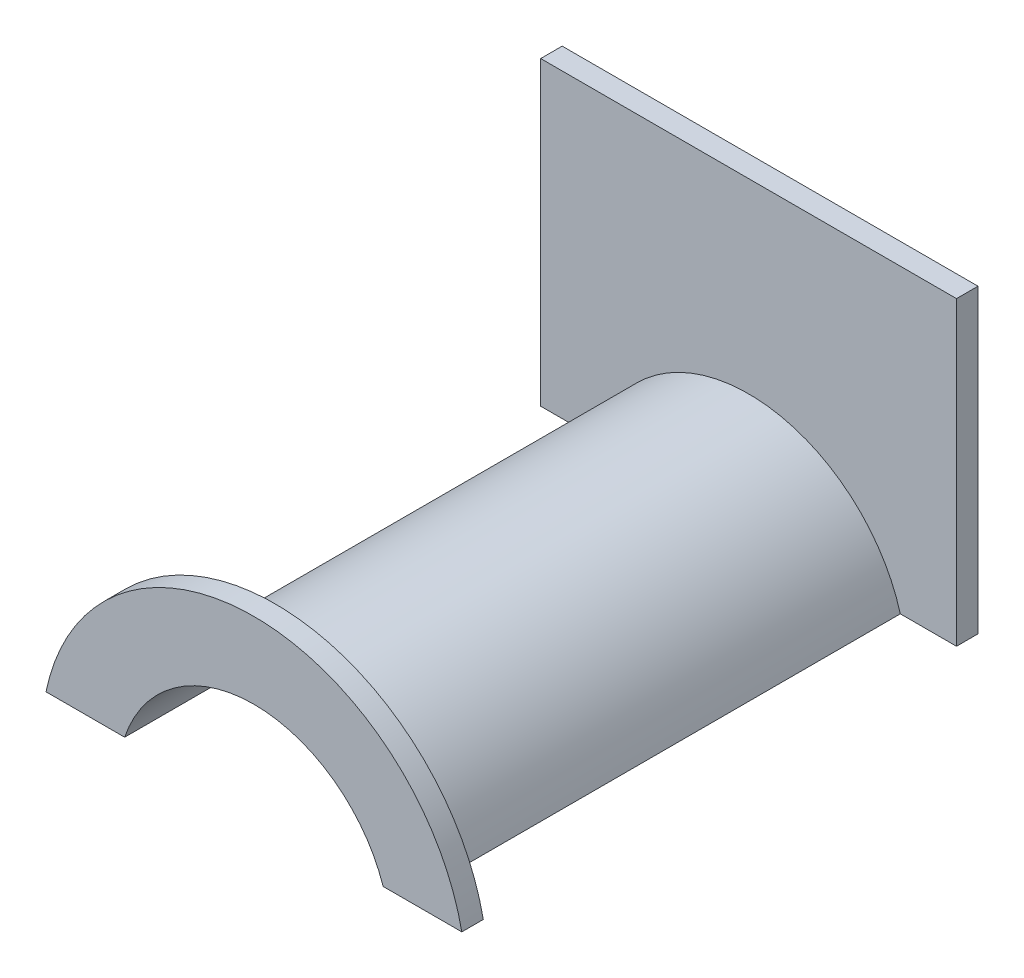
ISO-10303-21;
HEADER;
FILE_DESCRIPTION(('STEP AP214'),'2;1');
FILE_NAME('part.step','',(''),(''),'','','');
FILE_SCHEMA(('AUTOMOTIVE_DESIGN { 1 0 10303 214 1 1 1 1 }'));
ENDSEC;
DATA;
#1=APPLICATION_CONTEXT('core data for automotive mechanical design processes');
#2=APPLICATION_PROTOCOL_DEFINITION('international standard','automotive_design',2000,#1);
#3=PRODUCT_CONTEXT('',#1,'mechanical');
#4=PRODUCT('Part','Part','',(#3));
#5=PRODUCT_RELATED_PRODUCT_CATEGORY('part','',(#4));
#6=PRODUCT_DEFINITION_FORMATION('','',#4);
#7=PRODUCT_DEFINITION_CONTEXT('part definition',#1,'design');
#8=PRODUCT_DEFINITION('design','',#6,#7);
#9=PRODUCT_DEFINITION_SHAPE('','',#8);
#10=(LENGTH_UNIT() NAMED_UNIT(*) SI_UNIT(.MILLI.,.METRE.));
#11=(NAMED_UNIT(*) PLANE_ANGLE_UNIT() SI_UNIT($,.RADIAN.));
#12=(NAMED_UNIT(*) SI_UNIT($,.STERADIAN.) SOLID_ANGLE_UNIT());
#13=UNCERTAINTY_MEASURE_WITH_UNIT(LENGTH_MEASURE(1.E-05),#10,'distance_accuracy_value','');
#14=(GEOMETRIC_REPRESENTATION_CONTEXT(3) GLOBAL_UNCERTAINTY_ASSIGNED_CONTEXT((#13)) GLOBAL_UNIT_ASSIGNED_CONTEXT((#10,
#11,#12)) REPRESENTATION_CONTEXT('',''));
#15=CARTESIAN_POINT('',(0.,0.,0.));
#16=DIRECTION('',(0.,0.,1.));
#17=DIRECTION('',(1.,0.,0.));
#18=AXIS2_PLACEMENT_3D('',#15,#16,#17);
#19=CARTESIAN_POINT('',(0.29000000000002,0.20999999999998,-0.015));
#20=DIRECTION('',(1.,0.,0.));
#21=DIRECTION('',(0.,0.,-1.));
#22=AXIS2_PLACEMENT_3D('',#19,#20,#21);
#23=PLANE('',#22);
#24=DIRECTION('',(0.,1.,0.));
#25=VECTOR('',#24,1.);
#26=CARTESIAN_POINT('',(0.29000000000002,0.005704238144726,-0.015));
#27=LINE('',#26,#25);
#28=CARTESIAN_POINT('',(0.29000000000002,-0.210000000000017,-0.015));
#29=VERTEX_POINT('',#28);
#30=CARTESIAN_POINT('',(0.29000000000002,0.20999999999998,-0.015));
#31=VERTEX_POINT('',#30);
#32=EDGE_CURVE('E78',#29,#31,#27,.T.);
#33=ORIENTED_EDGE('',*,*,#32,.T.);
#34=DIRECTION('',(0.,0.,1.));
#35=VECTOR('',#34,1.);
#36=CARTESIAN_POINT('',(0.29000000000002,0.20999999999998,-0.015));
#37=LINE('',#36,#35);
#38=CARTESIAN_POINT('',(0.29000000000002,0.20999999999998,0.015));
#39=VERTEX_POINT('',#38);
#40=EDGE_CURVE('E97',#39,#31,#37,.F.);
#41=ORIENTED_EDGE('',*,*,#40,.F.);
#42=DIRECTION('',(0.,1.,0.));
#43=VECTOR('',#42,1.);
#44=CARTESIAN_POINT('',(0.29000000000002,0.005704238144726,0.015));
#45=LINE('',#44,#43);
#46=CARTESIAN_POINT('',(0.29000000000002,-0.210000000000012,0.015));
#47=VERTEX_POINT('',#46);
#48=EDGE_CURVE('E100',#47,#39,#45,.T.);
#49=ORIENTED_EDGE('',*,*,#48,.F.);
#50=DIRECTION('',(0.,0.,-1.));
#51=VECTOR('',#50,1.);
#52=CARTESIAN_POINT('',(0.29000000000002,-0.210000000000036,-0.015));
#53=LINE('',#52,#51);
#54=EDGE_CURVE('E115',#29,#47,#53,.F.);
#55=ORIENTED_EDGE('',*,*,#54,.F.);
#56=EDGE_LOOP('',(#33,#41,#49,#55));
#57=FACE_BOUND('',#56,.T.);
#58=ADVANCED_FACE('F16',(#57),#23,.T.);
#59=CARTESIAN_POINT('',(-0.289999999999964,0.20999999999998,-0.015));
#60=DIRECTION('',(0.,1.,0.));
#61=DIRECTION('',(0.,0.,1.));
#62=AXIS2_PLACEMENT_3D('',#59,#60,#61);
#63=PLANE('',#62);
#64=DIRECTION('',(1.,0.,0.));
#65=VECTOR('',#64,1.);
#66=CARTESIAN_POINT('',(0.,0.20999999999998,-0.015));
#67=LINE('',#66,#65);
#68=CARTESIAN_POINT('',(-0.289999999999964,0.20999999999998,-0.015));
#69=VERTEX_POINT('',#68);
#70=EDGE_CURVE('E135',#31,#69,#67,.F.);
#71=ORIENTED_EDGE('',*,*,#70,.T.);
#72=DIRECTION('',(0.,0.,1.));
#73=VECTOR('',#72,1.);
#74=CARTESIAN_POINT('',(-0.289999999999964,0.20999999999998,-0.015));
#75=LINE('',#74,#73);
#76=CARTESIAN_POINT('',(-0.289999999999964,0.20999999999998,0.015));
#77=VERTEX_POINT('',#76);
#78=EDGE_CURVE('E103',#77,#69,#75,.F.);
#79=ORIENTED_EDGE('',*,*,#78,.F.);
#80=DIRECTION('',(1.,0.,0.));
#81=VECTOR('',#80,1.);
#82=CARTESIAN_POINT('',(0.,0.20999999999998,0.015));
#83=LINE('',#82,#81);
#84=EDGE_CURVE('E106',#39,#77,#83,.F.);
#85=ORIENTED_EDGE('',*,*,#84,.F.);
#86=ORIENTED_EDGE('',*,*,#40,.T.);
#87=EDGE_LOOP('',(#71,#79,#85,#86));
#88=FACE_BOUND('',#87,.T.);
#89=ADVANCED_FACE('F107',(#88),#63,.T.);
#90=CARTESIAN_POINT('',(-0.289999999999964,-0.210000000000036,-0.015));
#91=DIRECTION('',(-1.,0.,0.));
#92=DIRECTION('',(0.,0.,1.));
#93=AXIS2_PLACEMENT_3D('',#90,#91,#92);
#94=PLANE('',#93);
#95=DIRECTION('',(0.,1.,0.));
#96=VECTOR('',#95,1.);
#97=CARTESIAN_POINT('',(-0.289999999999964,0.005704238144726,-0.015));
#98=LINE('',#97,#96);
#99=CARTESIAN_POINT('',(-0.289999999999964,-0.210000000000036,-0.015));
#100=VERTEX_POINT('',#99);
#101=EDGE_CURVE('E145',#69,#100,#98,.F.);
#102=ORIENTED_EDGE('',*,*,#101,.T.);
#103=DIRECTION('',(0.,0.,-1.));
#104=VECTOR('',#103,1.);
#105=CARTESIAN_POINT('',(-0.289999999999964,-0.210000000000036,-0.015));
#106=LINE('',#105,#104);
#107=CARTESIAN_POINT('',(-0.289999999999964,-0.210000000000036,0.015));
#108=VERTEX_POINT('',#107);
#109=EDGE_CURVE('E174',#108,#100,#106,.T.);
#110=ORIENTED_EDGE('',*,*,#109,.F.);
#111=DIRECTION('',(0.,1.,0.));
#112=VECTOR('',#111,1.);
#113=CARTESIAN_POINT('',(-0.289999999999964,0.005704238144726,0.015));
#114=LINE('',#113,#112);
#115=EDGE_CURVE('E110',#77,#108,#114,.F.);
#116=ORIENTED_EDGE('',*,*,#115,.F.);
#117=ORIENTED_EDGE('',*,*,#78,.T.);
#118=EDGE_LOOP('',(#102,#110,#116,#117));
#119=FACE_BOUND('',#118,.T.);
#120=ADVANCED_FACE('F187',(#119),#94,.T.);
#121=CARTESIAN_POINT('',(0.,0.005704238144726,-0.015));
#122=DIRECTION('',(0.,0.,1.));
#123=DIRECTION('',(1.,0.,0.));
#124=AXIS2_PLACEMENT_3D('',#121,#122,#123);
#125=PLANE('',#124);
#126=DIRECTION('',(1.,0.,0.));
#127=VECTOR('',#126,1.);
#128=CARTESIAN_POINT('',(-0.180277563773132,-0.210000000000036,-0.015));
#129=LINE('',#128,#127);
#130=CARTESIAN_POINT('',(-0.180277563773137,-0.210000000000036,-0.015));
#131=VERTEX_POINT('',#130);
#132=EDGE_CURVE('E177',#100,#131,#129,.T.);
#133=ORIENTED_EDGE('',*,*,#132,.F.);
#134=ORIENTED_EDGE('',*,*,#101,.F.);
#135=ORIENTED_EDGE('',*,*,#70,.F.);
#136=ORIENTED_EDGE('',*,*,#32,.F.);
#137=DIRECTION('',(1.,0.,0.));
#138=VECTOR('',#137,1.);
#139=CARTESIAN_POINT('',(0.29000000000002,-0.210000000000036,-0.015));
#140=LINE('',#139,#138);
#141=CARTESIAN_POINT('',(0.180277563773183,-0.210000000000036,-0.015));
#142=VERTEX_POINT('',#141);
#143=EDGE_CURVE('E123',#142,#29,#140,.T.);
#144=ORIENTED_EDGE('',*,*,#143,.F.);
#145=CARTESIAN_POINT('',(0.,-0.270000000000039,-0.015));
#146=DIRECTION('',(0.,0.,1.));
#147=DIRECTION('',(1.,0.,0.));
#148=AXIS2_PLACEMENT_3D('',#145,#146,#147);
#149=CIRCLE('',#148,0.19);
#150=EDGE_CURVE('E19',#142,#131,#149,.T.);
#151=ORIENTED_EDGE('',*,*,#150,.T.);
#152=EDGE_LOOP('',(#133,#134,#135,#136,#144,#151));
#153=FACE_BOUND('',#152,.T.);
#154=ADVANCED_FACE('F188',(#153),#125,.F.);
#155=CARTESIAN_POINT('',(0.,-0.270000000000039,-0.015));
#156=DIRECTION('',(0.,0.,1.));
#157=DIRECTION('',(1.,0.,0.));
#158=AXIS2_PLACEMENT_3D('',#155,#156,#157);
#159=CYLINDRICAL_SURFACE('',#158,0.19);
#160=ORIENTED_EDGE('',*,*,#150,.F.);
#161=DIRECTION('',(0.,0.,-1.));
#162=VECTOR('',#161,1.);
#163=CARTESIAN_POINT('',(0.180277563773111,-0.210000000000036,-0.015));
#164=LINE('',#163,#162);
#165=CARTESIAN_POINT('',(0.180277563773183,-0.210000000000036,0.705));
#166=VERTEX_POINT('',#165);
#167=EDGE_CURVE('E128',#166,#142,#164,.T.);
#168=ORIENTED_EDGE('',*,*,#167,.F.);
#169=CARTESIAN_POINT('',(0.,-0.270000000000039,0.705));
#170=DIRECTION('',(0.,0.,1.));
#171=DIRECTION('',(1.,0.,0.));
#172=AXIS2_PLACEMENT_3D('',#169,#170,#171);
#173=CIRCLE('',#172,0.19);
#174=CARTESIAN_POINT('',(-0.180277563773137,-0.210000000000036,0.705));
#175=VERTEX_POINT('',#174);
#176=EDGE_CURVE('E158',#175,#166,#173,.F.);
#177=ORIENTED_EDGE('',*,*,#176,.F.);
#178=DIRECTION('',(0.,0.,-1.));
#179=VECTOR('',#178,1.);
#180=CARTESIAN_POINT('',(-0.180277563773132,-0.210000000000036,-0.015));
#181=LINE('',#180,#179);
#182=EDGE_CURVE('E192',#131,#175,#181,.F.);
#183=ORIENTED_EDGE('',*,*,#182,.F.);
#184=EDGE_LOOP('',(#160,#168,#177,#183));
#185=FACE_BOUND('',#184,.T.);
#186=ADVANCED_FACE('F210',(#185),#159,.F.);
#187=CARTESIAN_POINT('',(0.,-0.112197892352626,0.705));
#188=DIRECTION('',(0.,0.,1.));
#189=DIRECTION('',(1.,0.,0.));
#190=AXIS2_PLACEMENT_3D('',#187,#188,#189);
#191=PLANE('',#190);
#192=CARTESIAN_POINT('',(0.,-0.27,0.705));
#193=DIRECTION('',(0.,0.,1.));
#194=DIRECTION('',(1.,0.,0.));
#195=AXIS2_PLACEMENT_3D('',#192,#193,#194);
#196=CIRCLE('',#195,0.296141857899217);
#197=CARTESIAN_POINT('',(-0.290000000000092,-0.210000000000036,0.705));
#198=VERTEX_POINT('',#197);
#199=CARTESIAN_POINT('',(0.289999999999916,-0.210000000000036,0.705));
#200=VERTEX_POINT('',#199);
#201=EDGE_CURVE('E157',#198,#200,#196,.F.);
#202=ORIENTED_EDGE('',*,*,#201,.F.);
#203=DIRECTION('',(1.,0.,0.));
#204=VECTOR('',#203,1.);
#205=CARTESIAN_POINT('',(-0.180277563773132,-0.210000000000036,0.705));
#206=LINE('',#205,#204);
#207=EDGE_CURVE('E207',#175,#198,#206,.F.);
#208=ORIENTED_EDGE('',*,*,#207,.F.);
#209=ORIENTED_EDGE('',*,*,#176,.T.);
#210=DIRECTION('',(1.,0.,0.));
#211=VECTOR('',#210,1.);
#212=CARTESIAN_POINT('',(0.29000000000002,-0.210000000000036,0.705));
#213=LINE('',#212,#211);
#214=EDGE_CURVE('E133',#200,#166,#213,.F.);
#215=ORIENTED_EDGE('',*,*,#214,.F.);
#216=EDGE_LOOP('',(#202,#208,#209,#215));
#217=FACE_BOUND('',#216,.T.);
#218=ADVANCED_FACE('F211',(#217),#191,.T.);
#219=CARTESIAN_POINT('',(0.,-0.27,0.675));
#220=DIRECTION('',(0.,0.,1.));
#221=DIRECTION('',(1.,0.,0.));
#222=AXIS2_PLACEMENT_3D('',#219,#220,#221);
#223=CYLINDRICAL_SURFACE('',#222,0.296141857899217);
#224=CARTESIAN_POINT('',(0.,-0.27,0.675));
#225=DIRECTION('',(0.,0.,1.));
#226=DIRECTION('',(1.,0.,0.));
#227=AXIS2_PLACEMENT_3D('',#224,#225,#226);
#228=CIRCLE('',#227,0.296141857899217);
#229=CARTESIAN_POINT('',(0.289999999999916,-0.210000000000036,0.675));
#230=VERTEX_POINT('',#229);
#231=CARTESIAN_POINT('',(-0.290000000000092,-0.210000000000036,0.675));
#232=VERTEX_POINT('',#231);
#233=EDGE_CURVE('E155',#230,#232,#228,.T.);
#234=ORIENTED_EDGE('',*,*,#233,.T.);
#235=DIRECTION('',(0.,0.,-1.));
#236=VECTOR('',#235,1.);
#237=CARTESIAN_POINT('',(-0.290000000000088,-0.210000000000036,-0.015));
#238=LINE('',#237,#236);
#239=EDGE_CURVE('E204',#198,#232,#238,.T.);
#240=ORIENTED_EDGE('',*,*,#239,.F.);
#241=ORIENTED_EDGE('',*,*,#201,.T.);
#242=DIRECTION('',(0.,0.,-1.));
#243=VECTOR('',#242,1.);
#244=CARTESIAN_POINT('',(0.289999999999912,-0.210000000000036,-0.015));
#245=LINE('',#244,#243);
#246=EDGE_CURVE('E140',#230,#200,#245,.F.);
#247=ORIENTED_EDGE('',*,*,#246,.F.);
#248=EDGE_LOOP('',(#234,#240,#241,#247));
#249=FACE_BOUND('',#248,.T.);
#250=ADVANCED_FACE('F215',(#249),#223,.T.);
#251=CARTESIAN_POINT('',(0.,-0.112197892352626,0.675));
#252=DIRECTION('',(0.,0.,1.));
#253=DIRECTION('',(1.,0.,0.));
#254=AXIS2_PLACEMENT_3D('',#251,#252,#253);
#255=PLANE('',#254);
#256=DIRECTION('',(1.,0.,0.));
#257=VECTOR('',#256,1.);
#258=CARTESIAN_POINT('',(-0.180277563773132,-0.210000000000036,0.675));
#259=LINE('',#258,#257);
#260=CARTESIAN_POINT('',(-0.21166010488526,-0.210000000000018,0.675));
#261=VERTEX_POINT('',#260);
#262=EDGE_CURVE('E154',#232,#261,#259,.T.);
#263=ORIENTED_EDGE('',*,*,#262,.F.);
#264=ORIENTED_EDGE('',*,*,#233,.F.);
#265=DIRECTION('',(1.,0.,0.));
#266=VECTOR('',#265,1.);
#267=CARTESIAN_POINT('',(0.29000000000002,-0.210000000000036,0.675));
#268=LINE('',#267,#266);
#269=CARTESIAN_POINT('',(0.211660104885084,-0.210000000000018,0.675));
#270=VERTEX_POINT('',#269);
#271=EDGE_CURVE('E143',#270,#230,#268,.T.);
#272=ORIENTED_EDGE('',*,*,#271,.F.);
#273=CARTESIAN_POINT('',(0.,-0.27,0.675));
#274=DIRECTION('',(0.,0.,1.));
#275=DIRECTION('',(1.,0.,0.));
#276=AXIS2_PLACEMENT_3D('',#273,#274,#275);
#277=CIRCLE('',#276,0.22);
#278=EDGE_CURVE('E151',#261,#270,#277,.F.);
#279=ORIENTED_EDGE('',*,*,#278,.F.);
#280=EDGE_LOOP('',(#263,#264,#272,#279));
#281=FACE_BOUND('',#280,.T.);
#282=ADVANCED_FACE('F226',(#281),#255,.F.);
#283=CARTESIAN_POINT('',(0.29000000000002,-0.210000000000036,-0.015));
#284=DIRECTION('',(0.,-1.,0.));
#285=DIRECTION('',(0.,0.,-1.));
#286=AXIS2_PLACEMENT_3D('',#283,#284,#285);
#287=PLANE('',#286);
#288=ORIENTED_EDGE('',*,*,#143,.T.);
#289=ORIENTED_EDGE('',*,*,#54,.T.);
#290=DIRECTION('',(1.,0.,0.));
#291=VECTOR('',#290,1.);
#292=CARTESIAN_POINT('',(0.,-0.21,0.015));
#293=LINE('',#292,#291);
#294=CARTESIAN_POINT('',(0.211660104885079,-0.21,0.015));
#295=VERTEX_POINT('',#294);
#296=EDGE_CURVE('E113',#295,#47,#293,.T.);
#297=ORIENTED_EDGE('',*,*,#296,.F.);
#298=DIRECTION('',(0.,0.,1.));
#299=VECTOR('',#298,1.);
#300=CARTESIAN_POINT('',(0.211660104885079,-0.21,0.015));
#301=LINE('',#300,#299);
#302=EDGE_CURVE('E150',#270,#295,#301,.F.);
#303=ORIENTED_EDGE('',*,*,#302,.F.);
#304=ORIENTED_EDGE('',*,*,#271,.T.);
#305=ORIENTED_EDGE('',*,*,#246,.T.);
#306=ORIENTED_EDGE('',*,*,#214,.T.);
#307=ORIENTED_EDGE('',*,*,#167,.T.);
#308=EDGE_LOOP('',(#288,#289,#297,#303,#304,#305,#306,#307));
#309=FACE_BOUND('',#308,.T.);
#310=ADVANCED_FACE('F225',(#309),#287,.T.);
#311=CARTESIAN_POINT('',(0.,0.005704238144726,0.015));
#312=DIRECTION('',(0.,0.,1.));
#313=DIRECTION('',(1.,0.,0.));
#314=AXIS2_PLACEMENT_3D('',#311,#312,#313);
#315=PLANE('',#314);
#316=ORIENTED_EDGE('',*,*,#115,.T.);
#317=DIRECTION('',(1.,0.,0.));
#318=VECTOR('',#317,1.);
#319=CARTESIAN_POINT('',(-0.180277563773132,-0.210000000000036,0.015));
#320=LINE('',#319,#318);
#321=CARTESIAN_POINT('',(-0.21166010488526,-0.210000000000018,0.015));
#322=VERTEX_POINT('',#321);
#323=EDGE_CURVE('E34',#322,#108,#320,.F.);
#324=ORIENTED_EDGE('',*,*,#323,.F.);
#325=CARTESIAN_POINT('',(0.,-0.27,0.015));
#326=DIRECTION('',(0.,0.,1.));
#327=DIRECTION('',(1.,0.,0.));
#328=AXIS2_PLACEMENT_3D('',#325,#326,#327);
#329=CIRCLE('',#328,0.22);
#330=EDGE_CURVE('E25',#295,#322,#329,.T.);
#331=ORIENTED_EDGE('',*,*,#330,.F.);
#332=ORIENTED_EDGE('',*,*,#296,.T.);
#333=ORIENTED_EDGE('',*,*,#48,.T.);
#334=ORIENTED_EDGE('',*,*,#84,.T.);
#335=EDGE_LOOP('',(#316,#324,#331,#332,#333,#334));
#336=FACE_BOUND('',#335,.T.);
#337=ADVANCED_FACE('F112',(#336),#315,.T.);
#338=CARTESIAN_POINT('',(-0.180277563773132,-0.210000000000036,-0.015));
#339=DIRECTION('',(0.,-1.,0.));
#340=DIRECTION('',(0.,0.,-1.));
#341=AXIS2_PLACEMENT_3D('',#338,#339,#340);
#342=PLANE('',#341);
#343=ORIENTED_EDGE('',*,*,#262,.T.);
#344=DIRECTION('',(0.,0.,1.));
#345=VECTOR('',#344,1.);
#346=CARTESIAN_POINT('',(-0.211660104885255,-0.21,0.015));
#347=LINE('',#346,#345);
#348=EDGE_CURVE('E10',#322,#261,#347,.T.);
#349=ORIENTED_EDGE('',*,*,#348,.F.);
#350=ORIENTED_EDGE('',*,*,#323,.T.);
#351=ORIENTED_EDGE('',*,*,#109,.T.);
#352=ORIENTED_EDGE('',*,*,#132,.T.);
#353=ORIENTED_EDGE('',*,*,#182,.T.);
#354=ORIENTED_EDGE('',*,*,#207,.T.);
#355=ORIENTED_EDGE('',*,*,#239,.T.);
#356=EDGE_LOOP('',(#343,#349,#350,#351,#352,#353,#354,#355));
#357=FACE_BOUND('',#356,.T.);
#358=ADVANCED_FACE('F194',(#357),#342,.T.);
#359=CARTESIAN_POINT('',(0.,-0.27,0.015));
#360=DIRECTION('',(0.,0.,1.));
#361=DIRECTION('',(1.,0.,0.));
#362=AXIS2_PLACEMENT_3D('',#359,#360,#361);
#363=CYLINDRICAL_SURFACE('',#362,0.22);
#364=ORIENTED_EDGE('',*,*,#330,.T.);
#365=ORIENTED_EDGE('',*,*,#348,.T.);
#366=ORIENTED_EDGE('',*,*,#278,.T.);
#367=ORIENTED_EDGE('',*,*,#302,.T.);
#368=EDGE_LOOP('',(#364,#365,#366,#367));
#369=FACE_BOUND('',#368,.T.);
#370=ADVANCED_FACE('F219',(#369),#363,.T.);
#371=CLOSED_SHELL('',(#58,#89,#120,#154,#186,#218,#250,#282,#310,#337,#358,#370));
#372=MANIFOLD_SOLID_BREP('B1',#371);
#373=ADVANCED_BREP_SHAPE_REPRESENTATION('',(#18,#372),#14);
#374=SHAPE_DEFINITION_REPRESENTATION(#9,#373);
ENDSEC;
END-ISO-10303-21;
